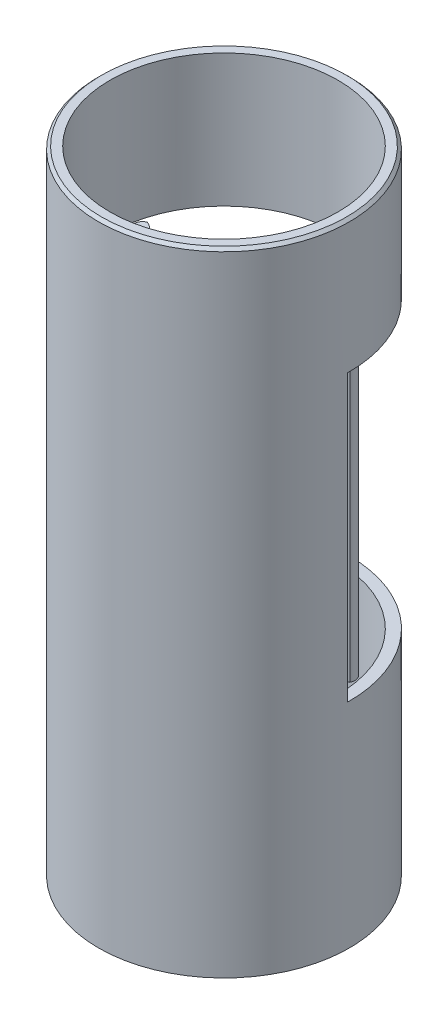
ISO-10303-21;
HEADER;
FILE_DESCRIPTION(('STEP AP214'),'2;1');
FILE_NAME('part.step','',(''),(''),'','','');
FILE_SCHEMA(('AUTOMOTIVE_DESIGN { 1 0 10303 214 1 1 1 1 }'));
ENDSEC;
DATA;
#1=APPLICATION_CONTEXT('core data for automotive mechanical design processes');
#2=APPLICATION_PROTOCOL_DEFINITION('international standard','automotive_design',2000,#1);
#3=PRODUCT_CONTEXT('',#1,'mechanical');
#4=PRODUCT('Part','Part','',(#3));
#5=PRODUCT_RELATED_PRODUCT_CATEGORY('part','',(#4));
#6=PRODUCT_DEFINITION_FORMATION('','',#4);
#7=PRODUCT_DEFINITION_CONTEXT('part definition',#1,'design');
#8=PRODUCT_DEFINITION('design','',#6,#7);
#9=PRODUCT_DEFINITION_SHAPE('','',#8);
#10=(LENGTH_UNIT() NAMED_UNIT(*) SI_UNIT(.MILLI.,.METRE.));
#11=(NAMED_UNIT(*) PLANE_ANGLE_UNIT() SI_UNIT($,.RADIAN.));
#12=(NAMED_UNIT(*) SI_UNIT($,.STERADIAN.) SOLID_ANGLE_UNIT());
#13=UNCERTAINTY_MEASURE_WITH_UNIT(LENGTH_MEASURE(1.E-05),#10,'distance_accuracy_value','');
#14=(GEOMETRIC_REPRESENTATION_CONTEXT(3) GLOBAL_UNCERTAINTY_ASSIGNED_CONTEXT((#13)) GLOBAL_UNIT_ASSIGNED_CONTEXT((#10,
#11,#12)) REPRESENTATION_CONTEXT('',''));
#15=CARTESIAN_POINT('',(0.,0.,0.));
#16=DIRECTION('',(0.,0.,1.));
#17=DIRECTION('',(1.,0.,0.));
#18=AXIS2_PLACEMENT_3D('',#15,#16,#17);
#19=CARTESIAN_POINT('',(0.,-40.,0.));
#20=DIRECTION('',(0.,1.,0.));
#21=DIRECTION('',(0.,0.,1.));
#22=AXIS2_PLACEMENT_3D('',#19,#20,#21);
#23=PLANE('',#22);
#24=CARTESIAN_POINT('',(15.9641605158936,-40.,-1.07031725333335));
#25=DIRECTION('',(0.,1.,0.));
#26=DIRECTION('',(0.,0.,-1.));
#27=AXIS2_PLACEMENT_3D('',#24,#25,#26);
#28=CIRCLE('',#27,1.37071519293082);
#29=CARTESIAN_POINT('',(15.358569496573,-40.,-2.3));
#30=VERTEX_POINT('',#29);
#31=CARTESIAN_POINT('',(15.9971872527642,-40.,0.3));
#32=VERTEX_POINT('',#31);
#33=EDGE_CURVE('E136',#30,#32,#28,.T.);
#34=ORIENTED_EDGE('',*,*,#33,.T.);
#35=CARTESIAN_POINT('',(0.,-40.,0.));
#36=DIRECTION('',(0.,-1.,0.));
#37=DIRECTION('',(0.,0.,-1.));
#38=AXIS2_PLACEMENT_3D('',#35,#36,#37);
#39=CIRCLE('',#38,16.);
#40=CARTESIAN_POINT('',(15.2429490925377,-40.,4.86338390036236));
#41=VERTEX_POINT('',#40);
#42=EDGE_CURVE('E206',#32,#41,#39,.T.);
#43=ORIENTED_EDGE('',*,*,#42,.T.);
#44=CARTESIAN_POINT('',(12.3848961376869,-40.,3.95149941904442));
#45=DIRECTION('',(0.,1.,0.));
#46=DIRECTION('',(0.,0.,1.));
#47=AXIS2_PLACEMENT_3D('',#44,#45,#46);
#48=CIRCLE('',#47,3.);
#49=CARTESIAN_POINT('',(14.1261141383704,-40.,1.50851766018993));
#50=VERTEX_POINT('',#49);
#51=EDGE_CURVE('E49',#41,#50,#48,.T.);
#52=ORIENTED_EDGE('',*,*,#51,.T.);
#53=CARTESIAN_POINT('',(15.9641605158936,-40.,-1.07031725333335));
#54=DIRECTION('',(0.,-1.,0.));
#55=DIRECTION('',(0.,0.,1.));
#56=AXIS2_PLACEMENT_3D('',#53,#54,#55);
#57=CIRCLE('',#56,3.16682869715634);
#58=CARTESIAN_POINT('',(14.7284278811159,-40.,-3.98609654067288));
#59=VERTEX_POINT('',#58);
#60=EDGE_CURVE('E293',#50,#59,#57,.T.);
#61=ORIENTED_EDGE('',*,*,#60,.T.);
#62=CARTESIAN_POINT('',(14.3,-40.,-2.86518193612776));
#63=DIRECTION('',(0.,-1.,0.));
#64=DIRECTION('',(0.,0.,1.));
#65=AXIS2_PLACEMENT_3D('',#62,#63,#64);
#66=CIRCLE('',#65,1.2);
#67=EDGE_CURVE('E319',#59,#30,#66,.T.);
#68=ORIENTED_EDGE('',*,*,#67,.T.);
#69=EDGE_LOOP('',(#34,#43,#52,#61,#68));
#70=FACE_BOUND('',#69,.T.);
#71=ADVANCED_FACE('F34',(#70),#23,.F.);
#72=CARTESIAN_POINT('',(-12.3848961376869,-40.,3.95149941904442));
#73=DIRECTION('',(0.,1.,0.));
#74=DIRECTION('',(0.,0.,1.));
#75=AXIS2_PLACEMENT_3D('',#72,#73,#74);
#76=CIRCLE('',#75,3.);
#77=CARTESIAN_POINT('',(-14.1261141383704,-40.,1.50851766018993));
#78=VERTEX_POINT('',#77);
#79=CARTESIAN_POINT('',(-15.2429490925377,-40.,4.86338390036236));
#80=VERTEX_POINT('',#79);
#81=EDGE_CURVE('E196',#78,#80,#76,.T.);
#82=ORIENTED_EDGE('',*,*,#81,.T.);
#83=CARTESIAN_POINT('',(-15.9971872527642,-40.,0.3));
#84=VERTEX_POINT('',#83);
#85=EDGE_CURVE('E200',#80,#84,#39,.T.);
#86=ORIENTED_EDGE('',*,*,#85,.T.);
#87=CARTESIAN_POINT('',(-15.9641605158936,-40.,-1.07031725333336));
#88=DIRECTION('',(0.,1.,0.));
#89=DIRECTION('',(0.,0.,1.));
#90=AXIS2_PLACEMENT_3D('',#87,#88,#89);
#91=CIRCLE('',#90,1.37071519293083);
#92=CARTESIAN_POINT('',(-15.358569496573,-40.,-2.3));
#93=VERTEX_POINT('',#92);
#94=EDGE_CURVE('E309',#84,#93,#91,.T.);
#95=ORIENTED_EDGE('',*,*,#94,.T.);
#96=CARTESIAN_POINT('',(-14.3,-40.,-2.86518193612776));
#97=DIRECTION('',(0.,-1.,0.));
#98=DIRECTION('',(0.,0.,-1.));
#99=AXIS2_PLACEMENT_3D('',#96,#97,#98);
#100=CIRCLE('',#99,1.2);
#101=CARTESIAN_POINT('',(-14.7284278811159,-40.,-3.98609654067288));
#102=VERTEX_POINT('',#101);
#103=EDGE_CURVE('E311',#93,#102,#100,.T.);
#104=ORIENTED_EDGE('',*,*,#103,.T.);
#105=CARTESIAN_POINT('',(-15.9641605158936,-40.,-1.07031725333336));
#106=DIRECTION('',(0.,-1.,0.));
#107=DIRECTION('',(0.,0.,-1.));
#108=AXIS2_PLACEMENT_3D('',#105,#106,#107);
#109=CIRCLE('',#108,3.16682869715635);
#110=EDGE_CURVE('E315',#102,#78,#109,.T.);
#111=ORIENTED_EDGE('',*,*,#110,.T.);
#112=EDGE_LOOP('',(#82,#86,#95,#104,#111));
#113=FACE_BOUND('',#112,.T.);
#114=ADVANCED_FACE('F230',(#113),#23,.F.);
#115=CARTESIAN_POINT('',(0.,0.,0.));
#116=DIRECTION('',(0.,1.,0.));
#117=DIRECTION('',(0.,0.,1.));
#118=AXIS2_PLACEMENT_3D('',#115,#116,#117);
#119=PLANE('',#118);
#120=DIRECTION('',(1.,0.,0.));
#121=VECTOR('',#120,1.);
#122=CARTESIAN_POINT('',(17.5974429960719,0.,0.3));
#123=LINE('',#122,#121);
#124=CARTESIAN_POINT('',(15.9971872527642,0.,0.300000000000001));
#125=VERTEX_POINT('',#124);
#126=CARTESIAN_POINT('',(17.5974429960719,0.,0.3));
#127=VERTEX_POINT('',#126);
#128=EDGE_CURVE('E151',#125,#127,#123,.T.);
#129=ORIENTED_EDGE('',*,*,#128,.F.);
#130=CARTESIAN_POINT('',(0.,0.,0.));
#131=DIRECTION('',(0.,1.,0.));
#132=DIRECTION('',(0.,0.,1.));
#133=AXIS2_PLACEMENT_3D('',#130,#131,#132);
#134=CIRCLE('',#133,16.);
#135=CARTESIAN_POINT('',(-15.9971872527642,0.,0.3));
#136=VERTEX_POINT('',#135);
#137=EDGE_CURVE('E182',#125,#136,#134,.T.);
#138=ORIENTED_EDGE('',*,*,#137,.T.);
#139=DIRECTION('',(1.,0.,0.));
#140=VECTOR('',#139,1.);
#141=CARTESIAN_POINT('',(-17.5974429960719,0.,0.3));
#142=LINE('',#141,#140);
#143=CARTESIAN_POINT('',(-17.5974429960719,0.,0.3));
#144=VERTEX_POINT('',#143);
#145=EDGE_CURVE('E322',#144,#136,#142,.T.);
#146=ORIENTED_EDGE('',*,*,#145,.F.);
#147=CARTESIAN_POINT('',(0.,0.,0.));
#148=DIRECTION('',(0.,1.,0.));
#149=DIRECTION('',(0.,0.,1.));
#150=AXIS2_PLACEMENT_3D('',#147,#148,#149);
#151=CIRCLE('',#150,17.6);
#152=EDGE_CURVE('E178',#127,#144,#151,.T.);
#153=ORIENTED_EDGE('',*,*,#152,.F.);
#154=EDGE_LOOP('',(#129,#138,#146,#153));
#155=FACE_BOUND('',#154,.T.);
#156=ADVANCED_FACE('F235',(#155),#119,.F.);
#157=CARTESIAN_POINT('',(0.,18.6,0.));
#158=DIRECTION('',(0.,1.,0.));
#159=DIRECTION('',(0.,0.,1.));
#160=AXIS2_PLACEMENT_3D('',#157,#158,#159);
#161=PLANE('',#160);
#162=CARTESIAN_POINT('',(0.,18.6,0.));
#163=DIRECTION('',(0.,1.,0.));
#164=DIRECTION('',(0.,0.,1.));
#165=AXIS2_PLACEMENT_3D('',#162,#163,#164);
#166=CIRCLE('',#165,17.2);
#167=CARTESIAN_POINT('',(0.,18.6,17.2));
#168=VERTEX_POINT('',#167);
#169=EDGE_CURVE('E42',#168,#168,#166,.T.);
#170=ORIENTED_EDGE('',*,*,#169,.T.);
#171=EDGE_LOOP('',(#170));
#172=FACE_BOUND('',#171,.T.);
#173=CARTESIAN_POINT('',(0.,18.6,0.));
#174=DIRECTION('',(0.,1.,0.));
#175=DIRECTION('',(0.,0.,1.));
#176=AXIS2_PLACEMENT_3D('',#173,#174,#175);
#177=CIRCLE('',#176,16.);
#178=CARTESIAN_POINT('',(0.,18.6,16.));
#179=VERTEX_POINT('',#178);
#180=EDGE_CURVE('E175',#179,#179,#177,.T.);
#181=ORIENTED_EDGE('',*,*,#180,.F.);
#182=EDGE_LOOP('',(#181));
#183=FACE_BOUND('',#182,.T.);
#184=ADVANCED_FACE('F276',(#172,#183),#161,.T.);
#185=CARTESIAN_POINT('',(0.,18.6,0.));
#186=DIRECTION('',(0.,-1.,0.));
#187=DIRECTION('',(0.,0.,-1.));
#188=AXIS2_PLACEMENT_3D('',#185,#186,#187);
#189=CYLINDRICAL_SURFACE('',#188,17.6);
#190=CARTESIAN_POINT('',(0.,18.2,0.));
#191=DIRECTION('',(0.,1.,0.));
#192=DIRECTION('',(0.,0.,1.));
#193=AXIS2_PLACEMENT_3D('',#190,#191,#192);
#194=CIRCLE('',#193,17.6);
#195=CARTESIAN_POINT('',(0.,18.2,17.6));
#196=VERTEX_POINT('',#195);
#197=EDGE_CURVE('E11',#196,#196,#194,.F.);
#198=ORIENTED_EDGE('',*,*,#197,.T.);
#199=EDGE_LOOP('',(#198));
#200=FACE_BOUND('',#199,.T.);
#201=ORIENTED_EDGE('',*,*,#152,.T.);
#202=DIRECTION('',(0.,1.,0.));
#203=VECTOR('',#202,1.);
#204=CARTESIAN_POINT('',(-17.5974429960719,-40.,0.3));
#205=LINE('',#204,#203);
#206=CARTESIAN_POINT('',(-17.5974429960719,-40.,0.3));
#207=VERTEX_POINT('',#206);
#208=EDGE_CURVE('E145',#207,#144,#205,.T.);
#209=ORIENTED_EDGE('',*,*,#208,.F.);
#210=CARTESIAN_POINT('',(0.,-40.,0.));
#211=DIRECTION('',(0.,-1.,0.));
#212=DIRECTION('',(0.,0.,-1.));
#213=AXIS2_PLACEMENT_3D('',#210,#211,#212);
#214=CIRCLE('',#213,17.6);
#215=CARTESIAN_POINT('',(17.5974429960719,-40.,0.3));
#216=VERTEX_POINT('',#215);
#217=EDGE_CURVE('E128',#207,#216,#214,.T.);
#218=ORIENTED_EDGE('',*,*,#217,.T.);
#219=DIRECTION('',(0.,1.,0.));
#220=VECTOR('',#219,1.);
#221=CARTESIAN_POINT('',(17.5974429960719,-40.,0.3));
#222=LINE('',#221,#220);
#223=EDGE_CURVE('E135',#216,#127,#222,.T.);
#224=ORIENTED_EDGE('',*,*,#223,.T.);
#225=EDGE_LOOP('',(#201,#209,#218,#224));
#226=FACE_BOUND('',#225,.T.);
#227=CARTESIAN_POINT('',(0.,-70.,0.));
#228=DIRECTION('',(0.,-1.,0.));
#229=DIRECTION('',(0.,0.,-1.));
#230=AXIS2_PLACEMENT_3D('',#227,#228,#229);
#231=CIRCLE('',#230,17.6);
#232=CARTESIAN_POINT('',(0.,-70.,-17.6));
#233=VERTEX_POINT('',#232);
#234=EDGE_CURVE('E146',#233,#233,#231,.T.);
#235=ORIENTED_EDGE('',*,*,#234,.F.);
#236=EDGE_LOOP('',(#235));
#237=FACE_BOUND('',#236,.T.);
#238=ADVANCED_FACE('F142',(#200,#226,#237),#189,.T.);
#239=CARTESIAN_POINT('',(0.,18.6,0.));
#240=DIRECTION('',(0.,-1.,0.));
#241=DIRECTION('',(0.,0.,-1.));
#242=AXIS2_PLACEMENT_3D('',#239,#240,#241);
#243=CYLINDRICAL_SURFACE('',#242,16.);
#244=ORIENTED_EDGE('',*,*,#180,.T.);
#245=EDGE_LOOP('',(#244));
#246=FACE_BOUND('',#245,.T.);
#247=DIRECTION('',(0.,-1.,0.));
#248=VECTOR('',#247,1.);
#249=CARTESIAN_POINT('',(15.2429490925377,18.6,4.86338390036236));
#250=LINE('',#249,#248);
#251=CARTESIAN_POINT('',(15.2429490925377,0.,4.86338390036236));
#252=VERTEX_POINT('',#251);
#253=EDGE_CURVE('E184',#252,#41,#250,.T.);
#254=ORIENTED_EDGE('',*,*,#253,.T.);
#255=ORIENTED_EDGE('',*,*,#42,.F.);
#256=EDGE_CURVE('E130',#84,#32,#39,.T.);
#257=ORIENTED_EDGE('',*,*,#256,.F.);
#258=ORIENTED_EDGE('',*,*,#85,.F.);
#259=DIRECTION('',(0.,-1.,0.));
#260=VECTOR('',#259,1.);
#261=CARTESIAN_POINT('',(-15.2429490925377,18.6,4.86338390036236));
#262=LINE('',#261,#260);
#263=CARTESIAN_POINT('',(-15.2429490925377,0.,4.86338390036236));
#264=VERTEX_POINT('',#263);
#265=EDGE_CURVE('E187',#80,#264,#262,.F.);
#266=ORIENTED_EDGE('',*,*,#265,.T.);
#267=EDGE_CURVE('E174',#136,#264,#134,.T.);
#268=ORIENTED_EDGE('',*,*,#267,.F.);
#269=ORIENTED_EDGE('',*,*,#137,.F.);
#270=EDGE_CURVE('E179',#252,#125,#134,.T.);
#271=ORIENTED_EDGE('',*,*,#270,.F.);
#272=EDGE_LOOP('',(#254,#255,#257,#258,#266,#268,#269,#271));
#273=FACE_BOUND('',#272,.T.);
#274=CARTESIAN_POINT('',(0.,-70.,0.));
#275=DIRECTION('',(0.,-1.,0.));
#276=DIRECTION('',(0.,0.,-1.));
#277=AXIS2_PLACEMENT_3D('',#274,#275,#276);
#278=CIRCLE('',#277,16.);
#279=CARTESIAN_POINT('',(0.,-70.,-16.));
#280=VERTEX_POINT('',#279);
#281=EDGE_CURVE('E147',#280,#280,#278,.T.);
#282=ORIENTED_EDGE('',*,*,#281,.T.);
#283=EDGE_LOOP('',(#282));
#284=FACE_BOUND('',#283,.T.);
#285=ADVANCED_FACE('F215',(#246,#273,#284),#243,.F.);
#286=CARTESIAN_POINT('',(0.,0.,0.));
#287=DIRECTION('',(0.,1.,0.));
#288=DIRECTION('',(0.,0.,1.));
#289=AXIS2_PLACEMENT_3D('',#286,#287,#288);
#290=PLANE('',#289);
#291=CARTESIAN_POINT('',(15.9641605158936,0.,-1.07031725333335));
#292=DIRECTION('',(0.,-1.,0.));
#293=DIRECTION('',(0.,0.,1.));
#294=AXIS2_PLACEMENT_3D('',#291,#292,#293);
#295=CIRCLE('',#294,3.16682869715634);
#296=CARTESIAN_POINT('',(14.1261141383704,0.,1.50851766018993));
#297=VERTEX_POINT('',#296);
#298=CARTESIAN_POINT('',(14.7284278811159,0.,-3.98609654067288));
#299=VERTEX_POINT('',#298);
#300=EDGE_CURVE('E292',#297,#299,#295,.T.);
#301=ORIENTED_EDGE('',*,*,#300,.F.);
#302=CARTESIAN_POINT('',(12.3848961376869,0.,3.95149941904442));
#303=DIRECTION('',(0.,1.,0.));
#304=DIRECTION('',(0.,0.,1.));
#305=AXIS2_PLACEMENT_3D('',#302,#303,#304);
#306=CIRCLE('',#305,3.);
#307=EDGE_CURVE('E57',#297,#252,#306,.F.);
#308=ORIENTED_EDGE('',*,*,#307,.T.);
#309=ORIENTED_EDGE('',*,*,#270,.T.);
#310=CARTESIAN_POINT('',(15.9641605158936,0.,-1.07031725333335));
#311=DIRECTION('',(0.,1.,0.));
#312=DIRECTION('',(0.,0.,-1.));
#313=AXIS2_PLACEMENT_3D('',#310,#311,#312);
#314=CIRCLE('',#313,1.37071519293082);
#315=CARTESIAN_POINT('',(15.358569496573,0.,-2.3));
#316=VERTEX_POINT('',#315);
#317=EDGE_CURVE('E300',#316,#125,#314,.T.);
#318=ORIENTED_EDGE('',*,*,#317,.F.);
#319=CARTESIAN_POINT('',(14.3,0.,-2.86518193612776));
#320=DIRECTION('',(0.,-1.,0.));
#321=DIRECTION('',(0.,0.,1.));
#322=AXIS2_PLACEMENT_3D('',#319,#320,#321);
#323=CIRCLE('',#322,1.2);
#324=EDGE_CURVE('E297',#299,#316,#323,.T.);
#325=ORIENTED_EDGE('',*,*,#324,.F.);
#326=EDGE_LOOP('',(#301,#308,#309,#318,#325));
#327=FACE_BOUND('',#326,.T.);
#328=ADVANCED_FACE('F242',(#327),#290,.T.);
#329=CARTESIAN_POINT('',(-17.5974429960719,-40.,0.3));
#330=DIRECTION('',(0.,0.,1.));
#331=DIRECTION('',(1.,0.,0.));
#332=AXIS2_PLACEMENT_3D('',#329,#330,#331);
#333=PLANE('',#332);
#334=ORIENTED_EDGE('',*,*,#145,.T.);
#335=DIRECTION('',(0.,1.,0.));
#336=VECTOR('',#335,1.);
#337=CARTESIAN_POINT('',(-15.9971872527642,-40.,0.3));
#338=LINE('',#337,#336);
#339=EDGE_CURVE('E170',#84,#136,#338,.T.);
#340=ORIENTED_EDGE('',*,*,#339,.F.);
#341=DIRECTION('',(1.,0.,0.));
#342=VECTOR('',#341,1.);
#343=CARTESIAN_POINT('',(-17.5974429960719,-40.,0.3));
#344=LINE('',#343,#342);
#345=EDGE_CURVE('E308',#207,#84,#344,.T.);
#346=ORIENTED_EDGE('',*,*,#345,.F.);
#347=ORIENTED_EDGE('',*,*,#208,.T.);
#348=EDGE_LOOP('',(#334,#340,#346,#347));
#349=FACE_BOUND('',#348,.T.);
#350=ADVANCED_FACE('F268',(#349),#333,.F.);
#351=CARTESIAN_POINT('',(-15.9641605158936,-40.,-1.07031725333336));
#352=DIRECTION('',(0.,1.,0.));
#353=DIRECTION('',(0.,0.,1.));
#354=AXIS2_PLACEMENT_3D('',#351,#352,#353);
#355=CYLINDRICAL_SURFACE('',#354,1.37071519293083);
#356=CARTESIAN_POINT('',(-15.9641605158936,0.,-1.07031725333336));
#357=DIRECTION('',(0.,1.,0.));
#358=DIRECTION('',(0.,0.,1.));
#359=AXIS2_PLACEMENT_3D('',#356,#357,#358);
#360=CIRCLE('',#359,1.37071519293083);
#361=CARTESIAN_POINT('',(-15.358569496573,0.,-2.3));
#362=VERTEX_POINT('',#361);
#363=EDGE_CURVE('E325',#136,#362,#360,.T.);
#364=ORIENTED_EDGE('',*,*,#363,.T.);
#365=DIRECTION('',(0.,1.,0.));
#366=VECTOR('',#365,1.);
#367=CARTESIAN_POINT('',(-15.358569496573,-40.,-2.3));
#368=LINE('',#367,#366);
#369=EDGE_CURVE('E167',#93,#362,#368,.T.);
#370=ORIENTED_EDGE('',*,*,#369,.F.);
#371=ORIENTED_EDGE('',*,*,#94,.F.);
#372=ORIENTED_EDGE('',*,*,#339,.T.);
#373=EDGE_LOOP('',(#364,#370,#371,#372));
#374=FACE_BOUND('',#373,.T.);
#375=ADVANCED_FACE('F264',(#374),#355,.F.);
#376=CARTESIAN_POINT('',(-14.3,-40.,-2.86518193612776));
#377=DIRECTION('',(0.,1.,0.));
#378=DIRECTION('',(0.,0.,1.));
#379=AXIS2_PLACEMENT_3D('',#376,#377,#378);
#380=CYLINDRICAL_SURFACE('',#379,1.2);
#381=CARTESIAN_POINT('',(-14.3,0.,-2.86518193612776));
#382=DIRECTION('',(0.,-1.,0.));
#383=DIRECTION('',(0.,0.,-1.));
#384=AXIS2_PLACEMENT_3D('',#381,#382,#383);
#385=CIRCLE('',#384,1.2);
#386=CARTESIAN_POINT('',(-14.7284278811159,0.,-3.98609654067288));
#387=VERTEX_POINT('',#386);
#388=EDGE_CURVE('E303',#362,#387,#385,.T.);
#389=ORIENTED_EDGE('',*,*,#388,.T.);
#390=DIRECTION('',(0.,1.,0.));
#391=VECTOR('',#390,1.);
#392=CARTESIAN_POINT('',(-14.7284278811159,-40.,-3.98609654067288));
#393=LINE('',#392,#391);
#394=EDGE_CURVE('E164',#102,#387,#393,.T.);
#395=ORIENTED_EDGE('',*,*,#394,.F.);
#396=ORIENTED_EDGE('',*,*,#103,.F.);
#397=ORIENTED_EDGE('',*,*,#369,.T.);
#398=EDGE_LOOP('',(#389,#395,#396,#397));
#399=FACE_BOUND('',#398,.T.);
#400=ADVANCED_FACE('F260',(#399),#380,.T.);
#401=CARTESIAN_POINT('',(-15.9641605158936,-40.,-1.07031725333336));
#402=DIRECTION('',(0.,1.,0.));
#403=DIRECTION('',(0.,0.,1.));
#404=AXIS2_PLACEMENT_3D('',#401,#402,#403);
#405=CYLINDRICAL_SURFACE('',#404,3.16682869715635);
#406=CARTESIAN_POINT('',(-15.9641605158936,0.,-1.07031725333336));
#407=DIRECTION('',(0.,-1.,0.));
#408=DIRECTION('',(0.,0.,-1.));
#409=AXIS2_PLACEMENT_3D('',#406,#407,#408);
#410=CIRCLE('',#409,3.16682869715635);
#411=CARTESIAN_POINT('',(-14.1261141383704,0.,1.50851766018993));
#412=VERTEX_POINT('',#411);
#413=EDGE_CURVE('E298',#387,#412,#410,.T.);
#414=ORIENTED_EDGE('',*,*,#413,.T.);
#415=DIRECTION('',(0.,1.,0.));
#416=VECTOR('',#415,1.);
#417=CARTESIAN_POINT('',(-14.1261141383704,-40.,1.50851766018993));
#418=LINE('',#417,#416);
#419=EDGE_CURVE('E190',#412,#78,#418,.F.);
#420=ORIENTED_EDGE('',*,*,#419,.T.);
#421=ORIENTED_EDGE('',*,*,#110,.F.);
#422=ORIENTED_EDGE('',*,*,#394,.T.);
#423=EDGE_LOOP('',(#414,#420,#421,#422));
#424=FACE_BOUND('',#423,.T.);
#425=ADVANCED_FACE('F256',(#424),#405,.T.);
#426=CARTESIAN_POINT('',(15.9641605158936,-40.,-1.07031725333335));
#427=DIRECTION('',(0.,1.,0.));
#428=DIRECTION('',(0.,0.,1.));
#429=AXIS2_PLACEMENT_3D('',#426,#427,#428);
#430=CYLINDRICAL_SURFACE('',#429,3.16682869715634);
#431=ORIENTED_EDGE('',*,*,#60,.F.);
#432=DIRECTION('',(0.,1.,0.));
#433=VECTOR('',#432,1.);
#434=CARTESIAN_POINT('',(14.1261141383704,-40.,1.50851766018993));
#435=LINE('',#434,#433);
#436=EDGE_CURVE('E192',#50,#297,#435,.T.);
#437=ORIENTED_EDGE('',*,*,#436,.T.);
#438=ORIENTED_EDGE('',*,*,#300,.T.);
#439=DIRECTION('',(0.,1.,0.));
#440=VECTOR('',#439,1.);
#441=CARTESIAN_POINT('',(14.7284278811159,-40.,-3.98609654067288));
#442=LINE('',#441,#440);
#443=EDGE_CURVE('E161',#59,#299,#442,.T.);
#444=ORIENTED_EDGE('',*,*,#443,.F.);
#445=EDGE_LOOP('',(#431,#437,#438,#444));
#446=FACE_BOUND('',#445,.T.);
#447=ADVANCED_FACE('F252',(#446),#430,.T.);
#448=CARTESIAN_POINT('',(14.3,-40.,-2.86518193612776));
#449=DIRECTION('',(0.,1.,0.));
#450=DIRECTION('',(0.,0.,1.));
#451=AXIS2_PLACEMENT_3D('',#448,#449,#450);
#452=CYLINDRICAL_SURFACE('',#451,1.2);
#453=ORIENTED_EDGE('',*,*,#324,.T.);
#454=DIRECTION('',(0.,1.,0.));
#455=VECTOR('',#454,1.);
#456=CARTESIAN_POINT('',(15.358569496573,-40.,-2.3));
#457=LINE('',#456,#455);
#458=EDGE_CURVE('E154',#30,#316,#457,.T.);
#459=ORIENTED_EDGE('',*,*,#458,.F.);
#460=ORIENTED_EDGE('',*,*,#67,.F.);
#461=ORIENTED_EDGE('',*,*,#443,.T.);
#462=EDGE_LOOP('',(#453,#459,#460,#461));
#463=FACE_BOUND('',#462,.T.);
#464=ADVANCED_FACE('F248',(#463),#452,.T.);
#465=CARTESIAN_POINT('',(15.9641605158936,-40.,-1.07031725333335));
#466=DIRECTION('',(0.,1.,0.));
#467=DIRECTION('',(0.,0.,1.));
#468=AXIS2_PLACEMENT_3D('',#465,#466,#467);
#469=CYLINDRICAL_SURFACE('',#468,1.37071519293082);
#470=ORIENTED_EDGE('',*,*,#317,.T.);
#471=DIRECTION('',(0.,1.,0.));
#472=VECTOR('',#471,1.);
#473=CARTESIAN_POINT('',(15.9971872527642,-40.,0.3));
#474=LINE('',#473,#472);
#475=EDGE_CURVE('E152',#32,#125,#474,.T.);
#476=ORIENTED_EDGE('',*,*,#475,.F.);
#477=ORIENTED_EDGE('',*,*,#33,.F.);
#478=ORIENTED_EDGE('',*,*,#458,.T.);
#479=EDGE_LOOP('',(#470,#476,#477,#478));
#480=FACE_BOUND('',#479,.T.);
#481=ADVANCED_FACE('F245',(#480),#469,.F.);
#482=CARTESIAN_POINT('',(17.5974429960719,-40.,0.3));
#483=DIRECTION('',(0.,0.,1.));
#484=DIRECTION('',(1.,0.,0.));
#485=AXIS2_PLACEMENT_3D('',#482,#483,#484);
#486=PLANE('',#485);
#487=ORIENTED_EDGE('',*,*,#128,.T.);
#488=ORIENTED_EDGE('',*,*,#223,.F.);
#489=DIRECTION('',(1.,0.,0.));
#490=VECTOR('',#489,1.);
#491=CARTESIAN_POINT('',(17.5974429960719,-40.,0.3));
#492=LINE('',#491,#490);
#493=EDGE_CURVE('E124',#32,#216,#492,.T.);
#494=ORIENTED_EDGE('',*,*,#493,.F.);
#495=ORIENTED_EDGE('',*,*,#475,.T.);
#496=EDGE_LOOP('',(#487,#488,#494,#495));
#497=FACE_BOUND('',#496,.T.);
#498=ADVANCED_FACE('F150',(#497),#486,.F.);
#499=ORIENTED_EDGE('',*,*,#363,.F.);
#500=ORIENTED_EDGE('',*,*,#267,.T.);
#501=CARTESIAN_POINT('',(-12.3848961376869,0.,3.95149941904442));
#502=DIRECTION('',(0.,1.,0.));
#503=DIRECTION('',(0.,0.,1.));
#504=AXIS2_PLACEMENT_3D('',#501,#502,#503);
#505=CIRCLE('',#504,3.);
#506=EDGE_CURVE('E194',#264,#412,#505,.F.);
#507=ORIENTED_EDGE('',*,*,#506,.T.);
#508=ORIENTED_EDGE('',*,*,#413,.F.);
#509=ORIENTED_EDGE('',*,*,#388,.F.);
#510=EDGE_LOOP('',(#499,#500,#507,#508,#509));
#511=FACE_BOUND('',#510,.T.);
#512=ADVANCED_FACE('F237',(#511),#290,.T.);
#513=CARTESIAN_POINT('',(-12.3848961376869,-40.,3.95149941904442));
#514=DIRECTION('',(0.,1.,0.));
#515=DIRECTION('',(0.,0.,1.));
#516=AXIS2_PLACEMENT_3D('',#513,#514,#515);
#517=CYLINDRICAL_SURFACE('',#516,3.);
#518=ORIENTED_EDGE('',*,*,#81,.F.);
#519=ORIENTED_EDGE('',*,*,#419,.F.);
#520=ORIENTED_EDGE('',*,*,#506,.F.);
#521=ORIENTED_EDGE('',*,*,#265,.F.);
#522=EDGE_LOOP('',(#518,#519,#520,#521));
#523=FACE_BOUND('',#522,.T.);
#524=ADVANCED_FACE('F240',(#523),#517,.F.);
#525=CARTESIAN_POINT('',(12.3848961376869,18.6,3.95149941904442));
#526=DIRECTION('',(0.,1.,0.));
#527=DIRECTION('',(0.,0.,1.));
#528=AXIS2_PLACEMENT_3D('',#525,#526,#527);
#529=CYLINDRICAL_SURFACE('',#528,3.);
#530=ORIENTED_EDGE('',*,*,#51,.F.);
#531=ORIENTED_EDGE('',*,*,#253,.F.);
#532=ORIENTED_EDGE('',*,*,#307,.F.);
#533=ORIENTED_EDGE('',*,*,#436,.F.);
#534=EDGE_LOOP('',(#530,#531,#532,#533));
#535=FACE_BOUND('',#534,.T.);
#536=ADVANCED_FACE('F226',(#535),#529,.F.);
#537=CARTESIAN_POINT('',(0.,-40.,0.));
#538=DIRECTION('',(0.,-1.,0.));
#539=DIRECTION('',(0.,0.,-1.));
#540=AXIS2_PLACEMENT_3D('',#537,#538,#539);
#541=PLANE('',#540);
#542=ORIENTED_EDGE('',*,*,#217,.F.);
#543=ORIENTED_EDGE('',*,*,#345,.T.);
#544=ORIENTED_EDGE('',*,*,#256,.T.);
#545=ORIENTED_EDGE('',*,*,#493,.T.);
#546=EDGE_LOOP('',(#542,#543,#544,#545));
#547=FACE_BOUND('',#546,.T.);
#548=ADVANCED_FACE('F126',(#547),#541,.F.);
#549=CARTESIAN_POINT('',(0.,-70.,0.));
#550=DIRECTION('',(0.,-1.,0.));
#551=DIRECTION('',(0.,0.,-1.));
#552=AXIS2_PLACEMENT_3D('',#549,#550,#551);
#553=PLANE('',#552);
#554=ORIENTED_EDGE('',*,*,#234,.T.);
#555=EDGE_LOOP('',(#554));
#556=FACE_BOUND('',#555,.T.);
#557=ORIENTED_EDGE('',*,*,#281,.F.);
#558=EDGE_LOOP('',(#557));
#559=FACE_BOUND('',#558,.T.);
#560=ADVANCED_FACE('F217',(#556,#559),#553,.T.);
#561=CARTESIAN_POINT('',(0.,18.6,0.));
#562=DIRECTION('',(0.,-1.,0.));
#563=DIRECTION('',(0.,0.,-1.));
#564=AXIS2_PLACEMENT_3D('',#561,#562,#563);
#565=CONICAL_SURFACE('',#564,17.2,0.785398163397435);
#566=ORIENTED_EDGE('',*,*,#197,.F.);
#567=EDGE_LOOP('',(#566));
#568=FACE_BOUND('',#567,.T.);
#569=ORIENTED_EDGE('',*,*,#169,.F.);
#570=EDGE_LOOP('',(#569));
#571=FACE_BOUND('',#570,.T.);
#572=ADVANCED_FACE('F36',(#568,#571),#565,.T.);
#573=CLOSED_SHELL('',(#71,#114,#156,#184,#238,#285,#328,#350,#375,#400,#425,#447,#464,#481,#498,
#512,#524,#536,#548,#560,#572));
#574=MANIFOLD_SOLID_BREP('B2',#573);
#575=ADVANCED_BREP_SHAPE_REPRESENTATION('',(#18,#574),#14);
#576=SHAPE_DEFINITION_REPRESENTATION(#9,#575);
ENDSEC;
END-ISO-10303-21;
